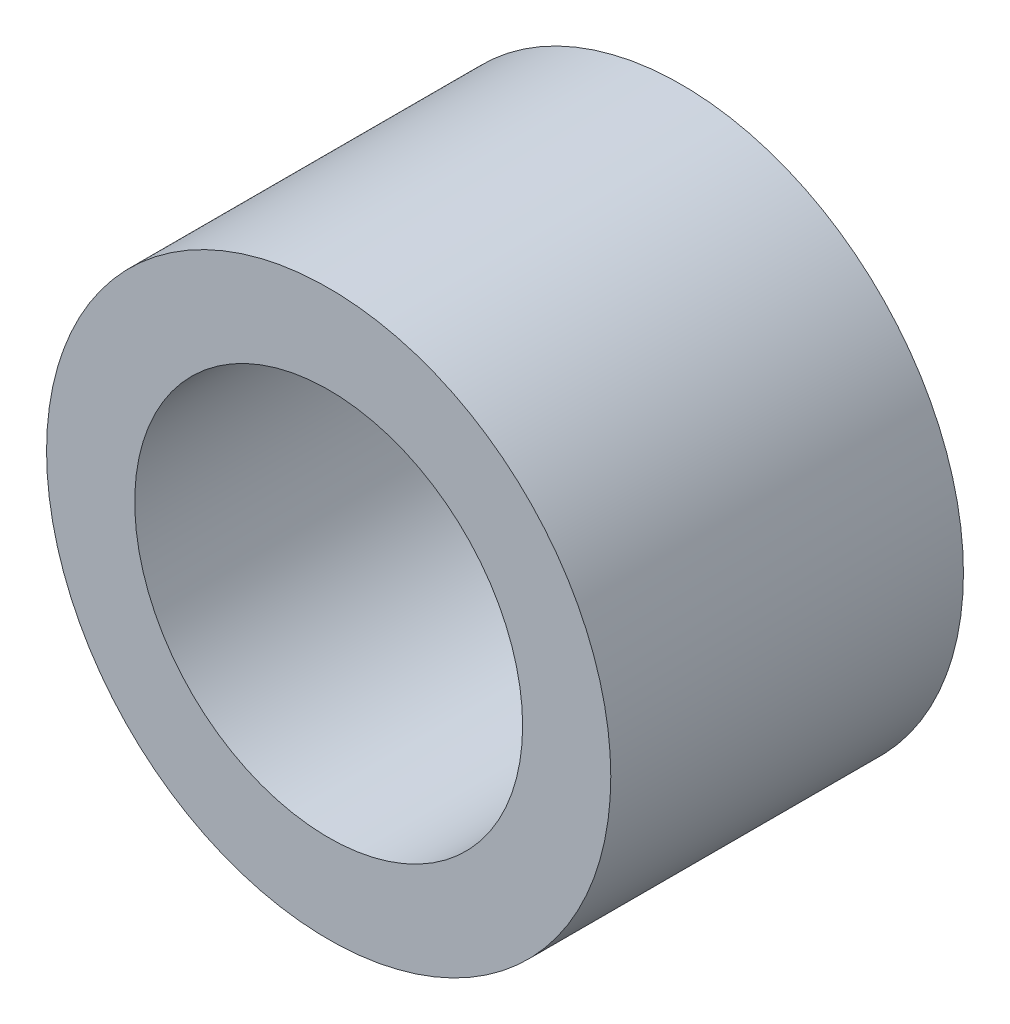
ISO-10303-21;
HEADER;
FILE_DESCRIPTION(('STEP AP214'),'2;1');
FILE_NAME('part.step','',(''),(''),'','','');
FILE_SCHEMA(('AUTOMOTIVE_DESIGN { 1 0 10303 214 1 1 1 1 }'));
ENDSEC;
DATA;
#1=APPLICATION_CONTEXT('core data for automotive mechanical design processes');
#2=APPLICATION_PROTOCOL_DEFINITION('international standard','automotive_design',2000,#1);
#3=PRODUCT_CONTEXT('',#1,'mechanical');
#4=PRODUCT('Part','Part','',(#3));
#5=PRODUCT_RELATED_PRODUCT_CATEGORY('part','',(#4));
#6=PRODUCT_DEFINITION_FORMATION('','',#4);
#7=PRODUCT_DEFINITION_CONTEXT('part definition',#1,'design');
#8=PRODUCT_DEFINITION('design','',#6,#7);
#9=PRODUCT_DEFINITION_SHAPE('','',#8);
#10=(LENGTH_UNIT() NAMED_UNIT(*) SI_UNIT(.MILLI.,.METRE.));
#11=(NAMED_UNIT(*) PLANE_ANGLE_UNIT() SI_UNIT($,.RADIAN.));
#12=(NAMED_UNIT(*) SI_UNIT($,.STERADIAN.) SOLID_ANGLE_UNIT());
#13=UNCERTAINTY_MEASURE_WITH_UNIT(LENGTH_MEASURE(1.E-05),#10,'distance_accuracy_value','');
#14=(GEOMETRIC_REPRESENTATION_CONTEXT(3) GLOBAL_UNCERTAINTY_ASSIGNED_CONTEXT((#13)) GLOBAL_UNIT_ASSIGNED_CONTEXT((#10,
#11,#12)) REPRESENTATION_CONTEXT('',''));
#15=CARTESIAN_POINT('',(0.,0.,0.));
#16=DIRECTION('',(0.,0.,1.));
#17=DIRECTION('',(1.,0.,0.));
#18=AXIS2_PLACEMENT_3D('',#15,#16,#17);
#19=CARTESIAN_POINT('',(0.,0.,5.));
#20=DIRECTION('',(0.,0.,1.));
#21=DIRECTION('',(1.,0.,0.));
#22=AXIS2_PLACEMENT_3D('',#19,#20,#21);
#23=PLANE('',#22);
#24=CARTESIAN_POINT('',(0.,0.,5.));
#25=DIRECTION('',(0.,0.,1.));
#26=DIRECTION('',(1.,0.,0.));
#27=AXIS2_PLACEMENT_3D('',#24,#25,#26);
#28=CIRCLE('',#27,4.);
#29=CARTESIAN_POINT('',(4.,0.,5.));
#30=VERTEX_POINT('',#29);
#31=EDGE_CURVE('E10',#30,#30,#28,.T.);
#32=ORIENTED_EDGE('',*,*,#31,.T.);
#33=EDGE_LOOP('',(#32));
#34=FACE_BOUND('',#33,.T.);
#35=CARTESIAN_POINT('',(0.,0.,5.));
#36=DIRECTION('',(0.,0.,1.));
#37=DIRECTION('',(1.,0.,0.));
#38=AXIS2_PLACEMENT_3D('',#35,#36,#37);
#39=CIRCLE('',#38,2.75);
#40=CARTESIAN_POINT('',(2.75,0.,5.));
#41=VERTEX_POINT('',#40);
#42=EDGE_CURVE('E46',#41,#41,#39,.T.);
#43=ORIENTED_EDGE('',*,*,#42,.F.);
#44=EDGE_LOOP('',(#43));
#45=FACE_BOUND('',#44,.T.);
#46=ADVANCED_FACE('F35',(#34,#45),#23,.T.);
#47=CARTESIAN_POINT('',(0.,0.,0.));
#48=DIRECTION('',(0.,0.,1.));
#49=DIRECTION('',(1.,0.,0.));
#50=AXIS2_PLACEMENT_3D('',#47,#48,#49);
#51=PLANE('',#50);
#52=CARTESIAN_POINT('',(0.,0.,0.));
#53=DIRECTION('',(0.,0.,1.));
#54=DIRECTION('',(1.,0.,0.));
#55=AXIS2_PLACEMENT_3D('',#52,#53,#54);
#56=CIRCLE('',#55,4.);
#57=CARTESIAN_POINT('',(4.,0.,0.));
#58=VERTEX_POINT('',#57);
#59=EDGE_CURVE('E39',#58,#58,#56,.T.);
#60=ORIENTED_EDGE('',*,*,#59,.F.);
#61=EDGE_LOOP('',(#60));
#62=FACE_BOUND('',#61,.T.);
#63=CARTESIAN_POINT('',(0.,0.,0.));
#64=DIRECTION('',(0.,0.,1.));
#65=DIRECTION('',(1.,0.,0.));
#66=AXIS2_PLACEMENT_3D('',#63,#64,#65);
#67=CIRCLE('',#66,2.75);
#68=CARTESIAN_POINT('',(2.75,0.,0.));
#69=VERTEX_POINT('',#68);
#70=EDGE_CURVE('E48',#69,#69,#67,.T.);
#71=ORIENTED_EDGE('',*,*,#70,.T.);
#72=EDGE_LOOP('',(#71));
#73=FACE_BOUND('',#72,.T.);
#74=ADVANCED_FACE('F58',(#62,#73),#51,.F.);
#75=CARTESIAN_POINT('',(0.,0.,5.));
#76=DIRECTION('',(0.,0.,-1.));
#77=DIRECTION('',(-1.,0.,0.));
#78=AXIS2_PLACEMENT_3D('',#75,#76,#77);
#79=CYLINDRICAL_SURFACE('',#78,4.);
#80=ORIENTED_EDGE('',*,*,#31,.F.);
#81=EDGE_LOOP('',(#80));
#82=FACE_BOUND('',#81,.T.);
#83=ORIENTED_EDGE('',*,*,#59,.T.);
#84=EDGE_LOOP('',(#83));
#85=FACE_BOUND('',#84,.T.);
#86=ADVANCED_FACE('F37',(#82,#85),#79,.T.);
#87=CARTESIAN_POINT('',(0.,0.,5.));
#88=DIRECTION('',(0.,0.,-1.));
#89=DIRECTION('',(-1.,0.,0.));
#90=AXIS2_PLACEMENT_3D('',#87,#88,#89);
#91=CYLINDRICAL_SURFACE('',#90,2.75);
#92=ORIENTED_EDGE('',*,*,#42,.T.);
#93=EDGE_LOOP('',(#92));
#94=FACE_BOUND('',#93,.T.);
#95=ORIENTED_EDGE('',*,*,#70,.F.);
#96=EDGE_LOOP('',(#95));
#97=FACE_BOUND('',#96,.T.);
#98=ADVANCED_FACE('F54',(#94,#97),#91,.F.);
#99=CLOSED_SHELL('',(#46,#74,#86,#98));
#100=MANIFOLD_SOLID_BREP('B2',#99);
#101=ADVANCED_BREP_SHAPE_REPRESENTATION('',(#18,#100),#14);
#102=SHAPE_DEFINITION_REPRESENTATION(#9,#101);
ENDSEC;
END-ISO-10303-21;
